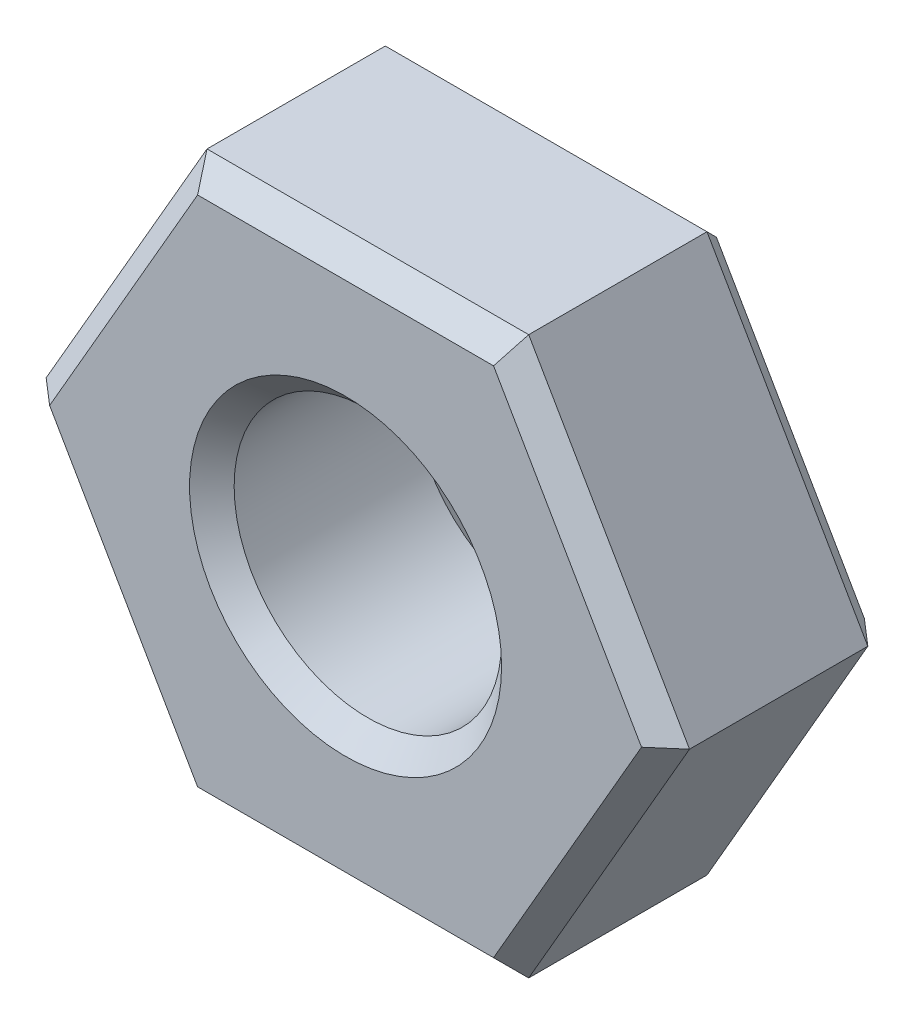
ISO-10303-21;
HEADER;
FILE_DESCRIPTION(('STEP AP214'),'2;1');
FILE_NAME('part.step','',(''),(''),'','','');
FILE_SCHEMA(('AUTOMOTIVE_DESIGN { 1 0 10303 214 1 1 1 1 }'));
ENDSEC;
DATA;
#1=APPLICATION_CONTEXT('core data for automotive mechanical design processes');
#2=APPLICATION_PROTOCOL_DEFINITION('international standard','automotive_design',2000,#1);
#3=PRODUCT_CONTEXT('',#1,'mechanical');
#4=PRODUCT('Part','Part','',(#3));
#5=PRODUCT_RELATED_PRODUCT_CATEGORY('part','',(#4));
#6=PRODUCT_DEFINITION_FORMATION('','',#4);
#7=PRODUCT_DEFINITION_CONTEXT('part definition',#1,'design');
#8=PRODUCT_DEFINITION('design','',#6,#7);
#9=PRODUCT_DEFINITION_SHAPE('','',#8);
#10=(LENGTH_UNIT() NAMED_UNIT(*) SI_UNIT(.MILLI.,.METRE.));
#11=(NAMED_UNIT(*) PLANE_ANGLE_UNIT() SI_UNIT($,.RADIAN.));
#12=(NAMED_UNIT(*) SI_UNIT($,.STERADIAN.) SOLID_ANGLE_UNIT());
#13=UNCERTAINTY_MEASURE_WITH_UNIT(LENGTH_MEASURE(1.E-05),#10,'distance_accuracy_value','');
#14=(GEOMETRIC_REPRESENTATION_CONTEXT(3) GLOBAL_UNCERTAINTY_ASSIGNED_CONTEXT((#13)) GLOBAL_UNIT_ASSIGNED_CONTEXT((#10,
#11,#12)) REPRESENTATION_CONTEXT('',''));
#15=CARTESIAN_POINT('',(0.,0.,0.));
#16=DIRECTION('',(0.,0.,1.));
#17=DIRECTION('',(1.,0.,0.));
#18=AXIS2_PLACEMENT_3D('',#15,#16,#17);
#19=CARTESIAN_POINT('',(2.88675134594813,0.,2.));
#20=DIRECTION('',(0.,0.,1.));
#21=DIRECTION('',(1.,0.,0.));
#22=AXIS2_PLACEMENT_3D('',#19,#20,#21);
#23=PLANE('',#22);
#24=CARTESIAN_POINT('',(0.,0.,2.00000000006639));
#25=DIRECTION('',(0.,0.,1.));
#26=DIRECTION('',(1.,0.,0.));
#27=AXIS2_PLACEMENT_3D('',#24,#25,#26);
#28=CIRCLE('',#27,1.39999999998963);
#29=CARTESIAN_POINT('',(1.39999999998963,0.,2.00000000006639));
#30=VERTEX_POINT('',#29);
#31=EDGE_CURVE('E20',#30,#30,#28,.F.);
#32=ORIENTED_EDGE('',*,*,#31,.T.);
#33=EDGE_LOOP('',(#32));
#34=FACE_BOUND('',#33,.T.);
#35=DIRECTION('',(-0.499999999999999,-0.866025403784439,0.));
#36=VECTOR('',#35,1.);
#37=CARTESIAN_POINT('',(2.65581123827228,0.,2.));
#38=LINE('',#37,#36);
#39=CARTESIAN_POINT('',(2.65581123827228,0.,2.));
#40=VERTEX_POINT('',#39);
#41=CARTESIAN_POINT('',(1.32790561913614,-2.3,2.));
#42=VERTEX_POINT('',#41);
#43=EDGE_CURVE('E139',#40,#42,#38,.T.);
#44=ORIENTED_EDGE('',*,*,#43,.F.);
#45=DIRECTION('',(0.5,-0.866025403784438,0.));
#46=VECTOR('',#45,1.);
#47=CARTESIAN_POINT('',(1.32790561913614,2.3,2.));
#48=LINE('',#47,#46);
#49=CARTESIAN_POINT('',(1.32790561913614,2.3,2.));
#50=VERTEX_POINT('',#49);
#51=EDGE_CURVE('E121',#50,#40,#48,.T.);
#52=ORIENTED_EDGE('',*,*,#51,.F.);
#53=DIRECTION('',(1.,0.,0.));
#54=VECTOR('',#53,1.);
#55=CARTESIAN_POINT('',(2.88675134594813,2.3,2.));
#56=LINE('',#55,#54);
#57=CARTESIAN_POINT('',(-1.32790561913614,2.3,2.));
#58=VERTEX_POINT('',#57);
#59=EDGE_CURVE('E117',#58,#50,#56,.T.);
#60=ORIENTED_EDGE('',*,*,#59,.F.);
#61=DIRECTION('',(0.5,0.866025403784439,0.));
#62=VECTOR('',#61,1.);
#63=CARTESIAN_POINT('',(-2.65581123827228,0.,2.));
#64=LINE('',#63,#62);
#65=CARTESIAN_POINT('',(-2.65581123827228,0.,2.));
#66=VERTEX_POINT('',#65);
#67=EDGE_CURVE('E108',#66,#58,#64,.T.);
#68=ORIENTED_EDGE('',*,*,#67,.F.);
#69=DIRECTION('',(-0.5,0.866025403784438,0.));
#70=VECTOR('',#69,1.);
#71=CARTESIAN_POINT('',(-1.32790561913614,-2.3,2.));
#72=LINE('',#71,#70);
#73=CARTESIAN_POINT('',(-1.32790561913614,-2.3,2.));
#74=VERTEX_POINT('',#73);
#75=EDGE_CURVE('E103',#74,#66,#72,.T.);
#76=ORIENTED_EDGE('',*,*,#75,.F.);
#77=DIRECTION('',(1.,0.,0.));
#78=VECTOR('',#77,1.);
#79=CARTESIAN_POINT('',(2.88675134594813,-2.3,2.));
#80=LINE('',#79,#78);
#81=EDGE_CURVE('E133',#42,#74,#80,.F.);
#82=ORIENTED_EDGE('',*,*,#81,.F.);
#83=EDGE_LOOP('',(#44,#52,#60,#68,#76,#82));
#84=FACE_BOUND('',#83,.T.);
#85=ADVANCED_FACE('F17',(#34,#84),#23,.T.);
#86=CARTESIAN_POINT('',(2.88675134594813,2.3,2.));
#87=DIRECTION('',(0.,0.707106781186549,0.707106781186546));
#88=DIRECTION('',(0.,-0.707106781186546,0.707106781186549));
#89=AXIS2_PLACEMENT_3D('',#86,#87,#88);
#90=PLANE('',#89);
#91=DIRECTION('',(-0.377964473009225,-0.654653670707976,0.654653670707979));
#92=VECTOR('',#91,1.);
#93=CARTESIAN_POINT('',(1.44337567297406,2.5,1.8));
#94=LINE('',#93,#92);
#95=CARTESIAN_POINT('',(1.44337567297406,2.5,1.8));
#96=VERTEX_POINT('',#95);
#97=EDGE_CURVE('E144',#96,#50,#94,.T.);
#98=ORIENTED_EDGE('',*,*,#97,.F.);
#99=DIRECTION('',(1.,0.,0.));
#100=VECTOR('',#99,1.);
#101=CARTESIAN_POINT('',(1.44337567297406,2.5,1.8));
#102=LINE('',#101,#100);
#103=CARTESIAN_POINT('',(-1.44337567297407,2.5,1.8));
#104=VERTEX_POINT('',#103);
#105=EDGE_CURVE('E127',#96,#104,#102,.F.);
#106=ORIENTED_EDGE('',*,*,#105,.T.);
#107=DIRECTION('',(-0.377964473009223,0.654653670707977,-0.65465367070798));
#108=VECTOR('',#107,1.);
#109=CARTESIAN_POINT('',(-1.32790561913614,2.3,2.));
#110=LINE('',#109,#108);
#111=EDGE_CURVE('E113',#58,#104,#110,.T.);
#112=ORIENTED_EDGE('',*,*,#111,.F.);
#113=ORIENTED_EDGE('',*,*,#59,.T.);
#114=EDGE_LOOP('',(#98,#106,#112,#113));
#115=FACE_BOUND('',#114,.T.);
#116=ADVANCED_FACE('F126',(#115),#90,.T.);
#117=CARTESIAN_POINT('',(-1.27017059221718,2.4,2.));
#118=DIRECTION('',(-0.612372435695798,0.353553390593275,0.707106781186544));
#119=DIRECTION('',(0.755928946018451,0.,0.654653670707981));
#120=AXIS2_PLACEMENT_3D('',#117,#118,#119);
#121=PLANE('',#120);
#122=ORIENTED_EDGE('',*,*,#111,.T.);
#123=DIRECTION('',(0.5,0.866025403784439,0.));
#124=VECTOR('',#123,1.);
#125=CARTESIAN_POINT('',(-1.44337567297407,2.5,1.8));
#126=LINE('',#125,#124);
#127=CARTESIAN_POINT('',(-2.88675134594813,0.,1.8));
#128=VERTEX_POINT('',#127);
#129=EDGE_CURVE('E156',#104,#128,#126,.F.);
#130=ORIENTED_EDGE('',*,*,#129,.T.);
#131=DIRECTION('',(0.755928946018454,0.,0.654653670707977));
#132=VECTOR('',#131,1.);
#133=CARTESIAN_POINT('',(-1.86401658338365,0.,2.68571428571429));
#134=LINE('',#133,#132);
#135=EDGE_CURVE('E115',#66,#128,#134,.F.);
#136=ORIENTED_EDGE('',*,*,#135,.F.);
#137=ORIENTED_EDGE('',*,*,#67,.T.);
#138=EDGE_LOOP('',(#122,#130,#136,#137));
#139=FACE_BOUND('',#138,.T.);
#140=ADVANCED_FACE('F110',(#139),#121,.T.);
#141=CARTESIAN_POINT('',(-1.27017059221718,-2.4,2.));
#142=DIRECTION('',(-0.612372435695795,-0.353553390593274,0.707106781186547));
#143=DIRECTION('',(0.755928946018454,0.,0.654653670707977));
#144=AXIS2_PLACEMENT_3D('',#141,#142,#143);
#145=PLANE('',#144);
#146=ORIENTED_EDGE('',*,*,#135,.T.);
#147=DIRECTION('',(-0.5,0.866025403784439,0.));
#148=VECTOR('',#147,1.);
#149=CARTESIAN_POINT('',(-2.88675134594813,0.,1.8));
#150=LINE('',#149,#148);
#151=CARTESIAN_POINT('',(-1.44337567297407,-2.5,1.8));
#152=VERTEX_POINT('',#151);
#153=EDGE_CURVE('E161',#128,#152,#150,.F.);
#154=ORIENTED_EDGE('',*,*,#153,.T.);
#155=DIRECTION('',(-0.377964473009229,-0.654653670707973,-0.65465367070798));
#156=VECTOR('',#155,1.);
#157=CARTESIAN_POINT('',(-1.32790561913614,-2.3,2.));
#158=LINE('',#157,#156);
#159=EDGE_CURVE('E135',#74,#152,#158,.T.);
#160=ORIENTED_EDGE('',*,*,#159,.F.);
#161=ORIENTED_EDGE('',*,*,#75,.T.);
#162=EDGE_LOOP('',(#146,#154,#160,#161));
#163=FACE_BOUND('',#162,.T.);
#164=ADVANCED_FACE('F475',(#163),#145,.T.);
#165=CARTESIAN_POINT('',(2.88675134594813,-2.3,2.));
#166=DIRECTION('',(0.,-0.707106781186549,0.707106781186546));
#167=DIRECTION('',(0.,-0.707106781186546,-0.707106781186549));
#168=AXIS2_PLACEMENT_3D('',#165,#166,#167);
#169=PLANE('',#168);
#170=ORIENTED_EDGE('',*,*,#159,.T.);
#171=DIRECTION('',(-1.,0.,0.));
#172=VECTOR('',#171,1.);
#173=CARTESIAN_POINT('',(-1.44337567297407,-2.5,1.8));
#174=LINE('',#173,#172);
#175=CARTESIAN_POINT('',(1.44337567297406,-2.5,1.8));
#176=VERTEX_POINT('',#175);
#177=EDGE_CURVE('E167',#152,#176,#174,.F.);
#178=ORIENTED_EDGE('',*,*,#177,.T.);
#179=DIRECTION('',(0.377964473009224,-0.654653670707978,-0.654653670707978));
#180=VECTOR('',#179,1.);
#181=CARTESIAN_POINT('',(1.32790561913614,-2.3,2.));
#182=LINE('',#181,#180);
#183=EDGE_CURVE('E137',#42,#176,#182,.T.);
#184=ORIENTED_EDGE('',*,*,#183,.F.);
#185=ORIENTED_EDGE('',*,*,#81,.T.);
#186=EDGE_LOOP('',(#170,#178,#184,#185));
#187=FACE_BOUND('',#186,.T.);
#188=ADVANCED_FACE('F466',(#187),#169,.T.);
#189=CARTESIAN_POINT('',(2.71354626519124,0.100000000000001,2.));
#190=DIRECTION('',(0.612372435695796,-0.353553390593274,0.707106781186546));
#191=DIRECTION('',(0.755928946018453,0.,-0.654653670707979));
#192=AXIS2_PLACEMENT_3D('',#189,#190,#191);
#193=PLANE('',#192);
#194=DIRECTION('',(0.755928946018453,0.,-0.654653670707979));
#195=VECTOR('',#194,1.);
#196=CARTESIAN_POINT('',(2.68880268222597,0.,1.97142857142857));
#197=LINE('',#196,#195);
#198=CARTESIAN_POINT('',(2.88675134594813,0.,1.8));
#199=VERTEX_POINT('',#198);
#200=EDGE_CURVE('E142',#40,#199,#197,.T.);
#201=ORIENTED_EDGE('',*,*,#200,.F.);
#202=ORIENTED_EDGE('',*,*,#43,.T.);
#203=ORIENTED_EDGE('',*,*,#183,.T.);
#204=DIRECTION('',(-0.5,-0.866025403784439,0.));
#205=VECTOR('',#204,1.);
#206=CARTESIAN_POINT('',(1.44337567297406,-2.5,1.8));
#207=LINE('',#206,#205);
#208=EDGE_CURVE('E173',#176,#199,#207,.F.);
#209=ORIENTED_EDGE('',*,*,#208,.T.);
#210=EDGE_LOOP('',(#201,#202,#203,#209));
#211=FACE_BOUND('',#210,.T.);
#212=ADVANCED_FACE('F268',(#211),#193,.T.);
#213=CARTESIAN_POINT('',(2.71354626519124,-0.0999999999999998,2.));
#214=DIRECTION('',(0.612372435695796,0.353553390593275,0.707106781186545));
#215=DIRECTION('',(0.755928946018453,0.,-0.654653670707979));
#216=AXIS2_PLACEMENT_3D('',#213,#214,#215);
#217=PLANE('',#216);
#218=ORIENTED_EDGE('',*,*,#97,.T.);
#219=ORIENTED_EDGE('',*,*,#51,.T.);
#220=ORIENTED_EDGE('',*,*,#200,.T.);
#221=DIRECTION('',(0.5,-0.866025403784438,0.));
#222=VECTOR('',#221,1.);
#223=CARTESIAN_POINT('',(2.88675134594813,0.,1.8));
#224=LINE('',#223,#222);
#225=EDGE_CURVE('E179',#199,#96,#224,.F.);
#226=ORIENTED_EDGE('',*,*,#225,.T.);
#227=EDGE_LOOP('',(#218,#219,#220,#226));
#228=FACE_BOUND('',#227,.T.);
#229=ADVANCED_FACE('F264',(#228),#217,.T.);
#230=CARTESIAN_POINT('',(0.,0.,2.00000000006639));
#231=DIRECTION('',(0.,0.,1.));
#232=DIRECTION('',(1.,0.,0.));
#233=AXIS2_PLACEMENT_3D('',#230,#231,#232);
#234=CONICAL_SURFACE('',#233,1.39999999998963,0.78539816325534);
#235=CARTESIAN_POINT('',(0.,0.,1.8));
#236=DIRECTION('',(0.,0.,-1.));
#237=DIRECTION('',(-1.,0.,0.));
#238=AXIS2_PLACEMENT_3D('',#235,#236,#237);
#239=CIRCLE('',#238,1.2);
#240=CARTESIAN_POINT('',(-1.2,0.,1.8));
#241=VERTEX_POINT('',#240);
#242=EDGE_CURVE('E147',#241,#241,#239,.T.);
#243=ORIENTED_EDGE('',*,*,#242,.T.);
#244=EDGE_LOOP('',(#243));
#245=FACE_BOUND('',#244,.T.);
#246=ORIENTED_EDGE('',*,*,#31,.F.);
#247=EDGE_LOOP('',(#246));
#248=FACE_BOUND('',#247,.T.);
#249=ADVANCED_FACE('F288',(#245,#248),#234,.F.);
#250=CARTESIAN_POINT('',(1.44337567297406,2.5,2.));
#251=DIRECTION('',(0.,-1.,0.));
#252=DIRECTION('',(0.,0.,-1.));
#253=AXIS2_PLACEMENT_3D('',#250,#251,#252);
#254=PLANE('',#253);
#255=DIRECTION('',(0.,0.,1.));
#256=VECTOR('',#255,1.);
#257=CARTESIAN_POINT('',(-1.44337567297407,2.5,2.));
#258=LINE('',#257,#256);
#259=CARTESIAN_POINT('',(-1.44337567297407,2.5,0.199999999999999));
#260=VERTEX_POINT('',#259);
#261=EDGE_CURVE('E153',#260,#104,#258,.T.);
#262=ORIENTED_EDGE('',*,*,#261,.T.);
#263=ORIENTED_EDGE('',*,*,#105,.F.);
#264=DIRECTION('',(0.,0.,1.));
#265=VECTOR('',#264,1.);
#266=CARTESIAN_POINT('',(1.44337567297406,2.5,2.));
#267=LINE('',#266,#265);
#268=CARTESIAN_POINT('',(1.44337567297406,2.5,0.199999999999999));
#269=VERTEX_POINT('',#268);
#270=EDGE_CURVE('E151',#96,#269,#267,.F.);
#271=ORIENTED_EDGE('',*,*,#270,.T.);
#272=DIRECTION('',(1.,0.,0.));
#273=VECTOR('',#272,1.);
#274=CARTESIAN_POINT('',(1.44337567297406,2.5,0.199999999999999));
#275=LINE('',#274,#273);
#276=EDGE_CURVE('E150',#269,#260,#275,.F.);
#277=ORIENTED_EDGE('',*,*,#276,.T.);
#278=EDGE_LOOP('',(#262,#263,#271,#277));
#279=FACE_BOUND('',#278,.T.);
#280=ADVANCED_FACE('F259',(#279),#254,.F.);
#281=CARTESIAN_POINT('',(-1.44337567297407,2.5,2.));
#282=DIRECTION('',(0.866025403784439,-0.5,0.));
#283=DIRECTION('',(0.5,0.866025403784439,0.));
#284=AXIS2_PLACEMENT_3D('',#281,#282,#283);
#285=PLANE('',#284);
#286=DIRECTION('',(0.,0.,1.));
#287=VECTOR('',#286,1.);
#288=CARTESIAN_POINT('',(-2.88675134594813,0.,2.));
#289=LINE('',#288,#287);
#290=CARTESIAN_POINT('',(-2.88675134594813,0.,0.199999999999998));
#291=VERTEX_POINT('',#290);
#292=EDGE_CURVE('E158',#291,#128,#289,.T.);
#293=ORIENTED_EDGE('',*,*,#292,.T.);
#294=ORIENTED_EDGE('',*,*,#129,.F.);
#295=ORIENTED_EDGE('',*,*,#261,.F.);
#296=DIRECTION('',(-0.5,-0.866025403784439,0.));
#297=VECTOR('',#296,1.);
#298=CARTESIAN_POINT('',(-1.44337567297407,2.5,0.199999999999999));
#299=LINE('',#298,#297);
#300=EDGE_CURVE('E194',#260,#291,#299,.T.);
#301=ORIENTED_EDGE('',*,*,#300,.T.);
#302=EDGE_LOOP('',(#293,#294,#295,#301));
#303=FACE_BOUND('',#302,.T.);
#304=ADVANCED_FACE('F279',(#303),#285,.F.);
#305=CARTESIAN_POINT('',(-2.88675134594813,0.,2.));
#306=DIRECTION('',(0.866025403784439,0.5,0.));
#307=DIRECTION('',(-0.5,0.866025403784439,0.));
#308=AXIS2_PLACEMENT_3D('',#305,#306,#307);
#309=PLANE('',#308);
#310=DIRECTION('',(0.,0.,1.));
#311=VECTOR('',#310,1.);
#312=CARTESIAN_POINT('',(-1.44337567297407,-2.5,2.));
#313=LINE('',#312,#311);
#314=CARTESIAN_POINT('',(-1.44337567297407,-2.5,0.199999999999999));
#315=VERTEX_POINT('',#314);
#316=EDGE_CURVE('E164',#315,#152,#313,.T.);
#317=ORIENTED_EDGE('',*,*,#316,.T.);
#318=ORIENTED_EDGE('',*,*,#153,.F.);
#319=ORIENTED_EDGE('',*,*,#292,.F.);
#320=DIRECTION('',(0.5,-0.866025403784439,0.));
#321=VECTOR('',#320,1.);
#322=CARTESIAN_POINT('',(-2.88675134594813,0.,0.199999999999999));
#323=LINE('',#322,#321);
#324=EDGE_CURVE('E200',#291,#315,#323,.T.);
#325=ORIENTED_EDGE('',*,*,#324,.T.);
#326=EDGE_LOOP('',(#317,#318,#319,#325));
#327=FACE_BOUND('',#326,.T.);
#328=ADVANCED_FACE('F277',(#327),#309,.F.);
#329=CARTESIAN_POINT('',(-1.44337567297407,-2.5,2.));
#330=DIRECTION('',(0.,1.,0.));
#331=DIRECTION('',(-1.,0.,0.));
#332=AXIS2_PLACEMENT_3D('',#329,#330,#331);
#333=PLANE('',#332);
#334=DIRECTION('',(0.,0.,1.));
#335=VECTOR('',#334,1.);
#336=CARTESIAN_POINT('',(1.44337567297406,-2.5,2.));
#337=LINE('',#336,#335);
#338=CARTESIAN_POINT('',(1.44337567297406,-2.5,0.199999999999999));
#339=VERTEX_POINT('',#338);
#340=EDGE_CURVE('E170',#339,#176,#337,.T.);
#341=ORIENTED_EDGE('',*,*,#340,.T.);
#342=ORIENTED_EDGE('',*,*,#177,.F.);
#343=ORIENTED_EDGE('',*,*,#316,.F.);
#344=DIRECTION('',(1.,0.,0.));
#345=VECTOR('',#344,1.);
#346=CARTESIAN_POINT('',(-1.44337567297407,-2.5,0.199999999999999));
#347=LINE('',#346,#345);
#348=EDGE_CURVE('E206',#315,#339,#347,.T.);
#349=ORIENTED_EDGE('',*,*,#348,.T.);
#350=EDGE_LOOP('',(#341,#342,#343,#349));
#351=FACE_BOUND('',#350,.T.);
#352=ADVANCED_FACE('F274',(#351),#333,.F.);
#353=CARTESIAN_POINT('',(1.44337567297406,-2.5,2.));
#354=DIRECTION('',(-0.866025403784439,0.5,0.));
#355=DIRECTION('',(-0.5,-0.866025403784439,0.));
#356=AXIS2_PLACEMENT_3D('',#353,#354,#355);
#357=PLANE('',#356);
#358=DIRECTION('',(0.,0.,1.));
#359=VECTOR('',#358,1.);
#360=CARTESIAN_POINT('',(2.88675134594813,0.,2.));
#361=LINE('',#360,#359);
#362=CARTESIAN_POINT('',(2.88675134594813,0.,0.199999999999999));
#363=VERTEX_POINT('',#362);
#364=EDGE_CURVE('E176',#363,#199,#361,.T.);
#365=ORIENTED_EDGE('',*,*,#364,.T.);
#366=ORIENTED_EDGE('',*,*,#208,.F.);
#367=ORIENTED_EDGE('',*,*,#340,.F.);
#368=DIRECTION('',(0.499999999999999,0.866025403784439,0.));
#369=VECTOR('',#368,1.);
#370=CARTESIAN_POINT('',(1.44337567297406,-2.5,0.199999999999999));
#371=LINE('',#370,#369);
#372=EDGE_CURVE('E212',#339,#363,#371,.T.);
#373=ORIENTED_EDGE('',*,*,#372,.T.);
#374=EDGE_LOOP('',(#365,#366,#367,#373));
#375=FACE_BOUND('',#374,.T.);
#376=ADVANCED_FACE('F271',(#375),#357,.F.);
#377=CARTESIAN_POINT('',(2.88675134594813,0.,2.));
#378=DIRECTION('',(-0.866025403784438,-0.5,0.));
#379=DIRECTION('',(0.5,-0.866025403784438,0.));
#380=AXIS2_PLACEMENT_3D('',#377,#378,#379);
#381=PLANE('',#380);
#382=ORIENTED_EDGE('',*,*,#270,.F.);
#383=ORIENTED_EDGE('',*,*,#225,.F.);
#384=ORIENTED_EDGE('',*,*,#364,.F.);
#385=DIRECTION('',(-0.5,0.866025403784439,0.));
#386=VECTOR('',#385,1.);
#387=CARTESIAN_POINT('',(2.88675134594813,0.,0.199999999999999));
#388=LINE('',#387,#386);
#389=EDGE_CURVE('E216',#363,#269,#388,.T.);
#390=ORIENTED_EDGE('',*,*,#389,.T.);
#391=EDGE_LOOP('',(#382,#383,#384,#390));
#392=FACE_BOUND('',#391,.T.);
#393=ADVANCED_FACE('F262',(#392),#381,.F.);
#394=CARTESIAN_POINT('',(0.,0.,2.));
#395=DIRECTION('',(0.,0.,-1.));
#396=DIRECTION('',(-1.,0.,0.));
#397=AXIS2_PLACEMENT_3D('',#394,#395,#396);
#398=CYLINDRICAL_SURFACE('',#397,1.2);
#399=ORIENTED_EDGE('',*,*,#242,.F.);
#400=EDGE_LOOP('',(#399));
#401=FACE_BOUND('',#400,.T.);
#402=CARTESIAN_POINT('',(0.,0.,0.200000000006639));
#403=DIRECTION('',(0.,0.,-1.));
#404=DIRECTION('',(-1.,0.,0.));
#405=AXIS2_PLACEMENT_3D('',#402,#403,#404);
#406=CIRCLE('',#405,1.19999999998299);
#407=CARTESIAN_POINT('',(-1.19999999998299,0.,0.200000000006639));
#408=VERTEX_POINT('',#407);
#409=EDGE_CURVE('E184',#408,#408,#406,.T.);
#410=ORIENTED_EDGE('',*,*,#409,.T.);
#411=EDGE_LOOP('',(#410));
#412=FACE_BOUND('',#411,.T.);
#413=ADVANCED_FACE('F313',(#401,#412),#398,.F.);
#414=CARTESIAN_POINT('',(1.44337567297406,2.5,0.199999999999999));
#415=DIRECTION('',(0.,-0.707106781186546,0.707106781186549));
#416=DIRECTION('',(0.,-0.707106781186549,-0.707106781186546));
#417=AXIS2_PLACEMENT_3D('',#414,#415,#416);
#418=PLANE('',#417);
#419=DIRECTION('',(-0.377964473009225,-0.65465367070798,-0.654653670707975));
#420=VECTOR('',#419,1.);
#421=CARTESIAN_POINT('',(1.44337567297406,2.5,0.199999999999998));
#422=LINE('',#421,#420);
#423=CARTESIAN_POINT('',(1.32790561913614,2.3,0.));
#424=VERTEX_POINT('',#423);
#425=EDGE_CURVE('E188',#269,#424,#422,.T.);
#426=ORIENTED_EDGE('',*,*,#425,.T.);
#427=DIRECTION('',(1.,0.,0.));
#428=VECTOR('',#427,1.);
#429=CARTESIAN_POINT('',(2.88675134594813,2.3,0.));
#430=LINE('',#429,#428);
#431=CARTESIAN_POINT('',(-1.32790561913614,2.3,0.));
#432=VERTEX_POINT('',#431);
#433=EDGE_CURVE('E187',#424,#432,#430,.F.);
#434=ORIENTED_EDGE('',*,*,#433,.T.);
#435=DIRECTION('',(-0.377964473009226,0.654653670707978,0.654653670707976));
#436=VECTOR('',#435,1.);
#437=CARTESIAN_POINT('',(-1.32790561913614,2.3,0.));
#438=LINE('',#437,#436);
#439=EDGE_CURVE('E191',#432,#260,#438,.T.);
#440=ORIENTED_EDGE('',*,*,#439,.T.);
#441=ORIENTED_EDGE('',*,*,#276,.F.);
#442=EDGE_LOOP('',(#426,#434,#440,#441));
#443=FACE_BOUND('',#442,.T.);
#444=ADVANCED_FACE('F256',(#443),#418,.F.);
#445=CARTESIAN_POINT('',(-1.44337567297407,2.5,0.199999999999999));
#446=DIRECTION('',(0.612372435695794,-0.353553390593273,0.707106781186548));
#447=DIRECTION('',(0.755928946018455,0.,-0.654653670707977));
#448=AXIS2_PLACEMENT_3D('',#445,#446,#447);
#449=PLANE('',#448);
#450=ORIENTED_EDGE('',*,*,#439,.F.);
#451=DIRECTION('',(-0.5,-0.866025403784439,0.));
#452=VECTOR('',#451,1.);
#453=CARTESIAN_POINT('',(-1.32790561913614,2.3,0.));
#454=LINE('',#453,#452);
#455=CARTESIAN_POINT('',(-2.65581123827228,0.,0.));
#456=VERTEX_POINT('',#455);
#457=EDGE_CURVE('E223',#432,#456,#454,.T.);
#458=ORIENTED_EDGE('',*,*,#457,.T.);
#459=DIRECTION('',(0.755928946018456,0.,-0.654653670707976));
#460=VECTOR('',#459,1.);
#461=CARTESIAN_POINT('',(-2.88675134594813,0.,0.199999999999999));
#462=LINE('',#461,#460);
#463=EDGE_CURVE('E197',#456,#291,#462,.F.);
#464=ORIENTED_EDGE('',*,*,#463,.T.);
#465=ORIENTED_EDGE('',*,*,#300,.F.);
#466=EDGE_LOOP('',(#450,#458,#464,#465));
#467=FACE_BOUND('',#466,.T.);
#468=ADVANCED_FACE('F254',(#467),#449,.F.);
#469=CARTESIAN_POINT('',(-2.88675134594813,0.,0.199999999999999));
#470=DIRECTION('',(0.612372435695794,0.353553390593273,0.707106781186549));
#471=DIRECTION('',(0.755928946018456,0.,-0.654653670707976));
#472=AXIS2_PLACEMENT_3D('',#469,#470,#471);
#473=PLANE('',#472);
#474=DIRECTION('',(-0.377964473009229,-0.654653670707978,0.654653670707975));
#475=VECTOR('',#474,1.);
#476=CARTESIAN_POINT('',(-1.32790561913614,-2.3,0.));
#477=LINE('',#476,#475);
#478=CARTESIAN_POINT('',(-1.32790561913614,-2.3,0.));
#479=VERTEX_POINT('',#478);
#480=EDGE_CURVE('E203',#479,#315,#477,.T.);
#481=ORIENTED_EDGE('',*,*,#480,.T.);
#482=ORIENTED_EDGE('',*,*,#324,.F.);
#483=ORIENTED_EDGE('',*,*,#463,.F.);
#484=DIRECTION('',(0.5,-0.866025403784438,0.));
#485=VECTOR('',#484,1.);
#486=CARTESIAN_POINT('',(-2.65581123827228,0.,0.));
#487=LINE('',#486,#485);
#488=EDGE_CURVE('E226',#456,#479,#487,.T.);
#489=ORIENTED_EDGE('',*,*,#488,.T.);
#490=EDGE_LOOP('',(#481,#482,#483,#489));
#491=FACE_BOUND('',#490,.T.);
#492=ADVANCED_FACE('F250',(#491),#473,.F.);
#493=CARTESIAN_POINT('',(-1.44337567297407,-2.5,0.199999999999999));
#494=DIRECTION('',(0.,0.707106781186546,0.707106781186549));
#495=DIRECTION('',(0.,-0.707106781186549,0.707106781186546));
#496=AXIS2_PLACEMENT_3D('',#493,#494,#495);
#497=PLANE('',#496);
#498=DIRECTION('',(0.377964473009226,-0.654653670707979,0.654653670707976));
#499=VECTOR('',#498,1.);
#500=CARTESIAN_POINT('',(1.32790561913614,-2.3,0.));
#501=LINE('',#500,#499);
#502=CARTESIAN_POINT('',(1.32790561913614,-2.3,0.));
#503=VERTEX_POINT('',#502);
#504=EDGE_CURVE('E209',#503,#339,#501,.T.);
#505=ORIENTED_EDGE('',*,*,#504,.T.);
#506=ORIENTED_EDGE('',*,*,#348,.F.);
#507=ORIENTED_EDGE('',*,*,#480,.F.);
#508=DIRECTION('',(1.,0.,0.));
#509=VECTOR('',#508,1.);
#510=CARTESIAN_POINT('',(2.88675134594813,-2.3,0.));
#511=LINE('',#510,#509);
#512=EDGE_CURVE('E229',#479,#503,#511,.T.);
#513=ORIENTED_EDGE('',*,*,#512,.T.);
#514=EDGE_LOOP('',(#505,#506,#507,#513));
#515=FACE_BOUND('',#514,.T.);
#516=ADVANCED_FACE('F247',(#515),#497,.F.);
#517=CARTESIAN_POINT('',(1.44337567297406,-2.5,0.199999999999999));
#518=DIRECTION('',(-0.612372435695794,0.353553390593273,0.707106781186548));
#519=DIRECTION('',(0.755928946018455,0.,0.654653670707977));
#520=AXIS2_PLACEMENT_3D('',#517,#518,#519);
#521=PLANE('',#520);
#522=DIRECTION('',(0.755928946018456,0.,0.654653670707976));
#523=VECTOR('',#522,1.);
#524=CARTESIAN_POINT('',(2.88675134594813,0.,0.199999999999999));
#525=LINE('',#524,#523);
#526=CARTESIAN_POINT('',(2.65581123827228,0.,0.));
#527=VERTEX_POINT('',#526);
#528=EDGE_CURVE('E34',#527,#363,#525,.T.);
#529=ORIENTED_EDGE('',*,*,#528,.T.);
#530=ORIENTED_EDGE('',*,*,#372,.F.);
#531=ORIENTED_EDGE('',*,*,#504,.F.);
#532=DIRECTION('',(0.499999999999999,0.866025403784439,0.));
#533=VECTOR('',#532,1.);
#534=CARTESIAN_POINT('',(1.32790561913614,-2.3,0.));
#535=LINE('',#534,#533);
#536=EDGE_CURVE('E232',#503,#527,#535,.T.);
#537=ORIENTED_EDGE('',*,*,#536,.T.);
#538=EDGE_LOOP('',(#529,#530,#531,#537));
#539=FACE_BOUND('',#538,.T.);
#540=ADVANCED_FACE('F243',(#539),#521,.F.);
#541=CARTESIAN_POINT('',(2.88675134594813,0.,0.199999999999999));
#542=DIRECTION('',(-0.612372435695793,-0.353553390593273,0.707106781186549));
#543=DIRECTION('',(0.755928946018456,0.,0.654653670707976));
#544=AXIS2_PLACEMENT_3D('',#541,#542,#543);
#545=PLANE('',#544);
#546=ORIENTED_EDGE('',*,*,#425,.F.);
#547=ORIENTED_EDGE('',*,*,#389,.F.);
#548=ORIENTED_EDGE('',*,*,#528,.F.);
#549=DIRECTION('',(-0.5,0.866025403784439,0.));
#550=VECTOR('',#549,1.);
#551=CARTESIAN_POINT('',(2.65581123827228,0.,0.));
#552=LINE('',#551,#550);
#553=EDGE_CURVE('E26',#527,#424,#552,.T.);
#554=ORIENTED_EDGE('',*,*,#553,.T.);
#555=EDGE_LOOP('',(#546,#547,#548,#554));
#556=FACE_BOUND('',#555,.T.);
#557=ADVANCED_FACE('F236',(#556),#545,.F.);
#558=CARTESIAN_POINT('',(0.,0.,0.));
#559=DIRECTION('',(0.,0.,-1.));
#560=DIRECTION('',(-1.,0.,0.));
#561=AXIS2_PLACEMENT_3D('',#558,#559,#560);
#562=CONICAL_SURFACE('',#561,1.40000000004648,0.785398163539557);
#563=ORIENTED_EDGE('',*,*,#409,.F.);
#564=EDGE_LOOP('',(#563));
#565=FACE_BOUND('',#564,.T.);
#566=CARTESIAN_POINT('',(0.,0.,0.));
#567=DIRECTION('',(0.,0.,-1.));
#568=DIRECTION('',(-1.,0.,0.));
#569=AXIS2_PLACEMENT_3D('',#566,#567,#568);
#570=CIRCLE('',#569,1.40000000004648);
#571=CARTESIAN_POINT('',(-1.40000000004648,0.,0.));
#572=VERTEX_POINT('',#571);
#573=EDGE_CURVE('E11',#572,#572,#570,.T.);
#574=ORIENTED_EDGE('',*,*,#573,.T.);
#575=EDGE_LOOP('',(#574));
#576=FACE_BOUND('',#575,.T.);
#577=ADVANCED_FACE('F291',(#565,#576),#562,.F.);
#578=CARTESIAN_POINT('',(2.88675134594813,0.,0.));
#579=DIRECTION('',(0.,0.,1.));
#580=DIRECTION('',(1.,0.,0.));
#581=AXIS2_PLACEMENT_3D('',#578,#579,#580);
#582=PLANE('',#581);
#583=ORIENTED_EDGE('',*,*,#573,.F.);
#584=EDGE_LOOP('',(#583));
#585=FACE_BOUND('',#584,.T.);
#586=ORIENTED_EDGE('',*,*,#536,.F.);
#587=ORIENTED_EDGE('',*,*,#512,.F.);
#588=ORIENTED_EDGE('',*,*,#488,.F.);
#589=ORIENTED_EDGE('',*,*,#457,.F.);
#590=ORIENTED_EDGE('',*,*,#433,.F.);
#591=ORIENTED_EDGE('',*,*,#553,.F.);
#592=EDGE_LOOP('',(#586,#587,#588,#589,#590,#591));
#593=FACE_BOUND('',#592,.T.);
#594=ADVANCED_FACE('F239',(#585,#593),#582,.F.);
#595=CLOSED_SHELL('',(#85,#116,#140,#164,#188,#212,#229,#249,#280,#304,#328,#352,#376,#393,#413,
#444,#468,#492,#516,#540,#557,#577,#594));
#596=MANIFOLD_SOLID_BREP('B1',#595);
#597=ADVANCED_BREP_SHAPE_REPRESENTATION('',(#18,#596),#14);
#598=SHAPE_DEFINITION_REPRESENTATION(#9,#597);
ENDSEC;
END-ISO-10303-21;
